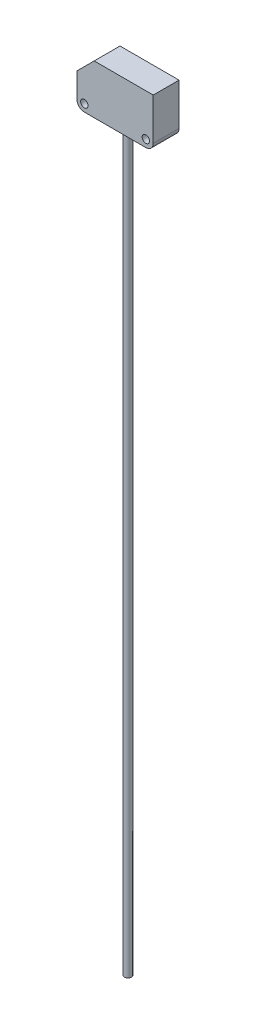
ISO-10303-21;
HEADER;
FILE_DESCRIPTION(('STEP AP214'),'2;1');
FILE_NAME('part.step','',(''),(''),'','','');
FILE_SCHEMA(('AUTOMOTIVE_DESIGN { 1 0 10303 214 1 1 1 1 }'));
ENDSEC;
DATA;
#1=APPLICATION_CONTEXT('core data for automotive mechanical design processes');
#2=APPLICATION_PROTOCOL_DEFINITION('international standard','automotive_design',2000,#1);
#3=PRODUCT_CONTEXT('',#1,'mechanical');
#4=PRODUCT('Part','Part','',(#3));
#5=PRODUCT_RELATED_PRODUCT_CATEGORY('part','',(#4));
#6=PRODUCT_DEFINITION_FORMATION('','',#4);
#7=PRODUCT_DEFINITION_CONTEXT('part definition',#1,'design');
#8=PRODUCT_DEFINITION('design','',#6,#7);
#9=PRODUCT_DEFINITION_SHAPE('','',#8);
#10=(LENGTH_UNIT() NAMED_UNIT(*) SI_UNIT(.MILLI.,.METRE.));
#11=(NAMED_UNIT(*) PLANE_ANGLE_UNIT() SI_UNIT($,.RADIAN.));
#12=(NAMED_UNIT(*) SI_UNIT($,.STERADIAN.) SOLID_ANGLE_UNIT());
#13=UNCERTAINTY_MEASURE_WITH_UNIT(LENGTH_MEASURE(1.E-05),#10,'distance_accuracy_value','');
#14=(GEOMETRIC_REPRESENTATION_CONTEXT(3) GLOBAL_UNCERTAINTY_ASSIGNED_CONTEXT((#13)) GLOBAL_UNIT_ASSIGNED_CONTEXT((#10,
#11,#12)) REPRESENTATION_CONTEXT('',''));
#15=CARTESIAN_POINT('',(0.,0.,0.));
#16=DIRECTION('',(0.,0.,1.));
#17=DIRECTION('',(1.,0.,0.));
#18=AXIS2_PLACEMENT_3D('',#15,#16,#17);
#19=CARTESIAN_POINT('',(0.,0.,-10.5));
#20=DIRECTION('',(0.,-1.,0.));
#21=DIRECTION('',(0.,0.,-1.));
#22=AXIS2_PLACEMENT_3D('',#19,#20,#21);
#23=PLANE('',#22);
#24=DIRECTION('',(1.,0.,0.));
#25=VECTOR('',#24,1.);
#26=CARTESIAN_POINT('',(0.,0.,-10.5));
#27=LINE('',#26,#25);
#28=CARTESIAN_POINT('',(3.,0.,-10.5));
#29=VERTEX_POINT('',#28);
#30=CARTESIAN_POINT('',(6.5,0.,-10.5));
#31=VERTEX_POINT('',#30);
#32=EDGE_CURVE('E163',#29,#31,#27,.T.);
#33=ORIENTED_EDGE('',*,*,#32,.T.);
#34=DIRECTION('',(0.,0.,-1.));
#35=VECTOR('',#34,1.);
#36=CARTESIAN_POINT('',(6.5,0.,0.));
#37=LINE('',#36,#35);
#38=CARTESIAN_POINT('',(6.5,0.,0.));
#39=VERTEX_POINT('',#38);
#40=EDGE_CURVE('E220',#39,#31,#37,.T.);
#41=ORIENTED_EDGE('',*,*,#40,.F.);
#42=DIRECTION('',(1.,0.,0.));
#43=VECTOR('',#42,1.);
#44=CARTESIAN_POINT('',(0.,0.,0.));
#45=LINE('',#44,#43);
#46=CARTESIAN_POINT('',(3.,0.,0.));
#47=VERTEX_POINT('',#46);
#48=EDGE_CURVE('E140',#47,#39,#45,.T.);
#49=ORIENTED_EDGE('',*,*,#48,.F.);
#50=DIRECTION('',(0.,0.,1.));
#51=VECTOR('',#50,1.);
#52=CARTESIAN_POINT('',(3.,0.,-10.5));
#53=LINE('',#52,#51);
#54=EDGE_CURVE('E188',#47,#29,#53,.F.);
#55=ORIENTED_EDGE('',*,*,#54,.T.);
#56=EDGE_LOOP('',(#33,#41,#49,#55));
#57=FACE_BOUND('',#56,.T.);
#58=ADVANCED_FACE('F34',(#57),#23,.T.);
#59=CARTESIAN_POINT('',(24.5,0.,0.));
#60=VERTEX_POINT('',#59);
#61=CARTESIAN_POINT('',(28.,0.,0.));
#62=VERTEX_POINT('',#61);
#63=EDGE_CURVE('E177',#60,#62,#45,.T.);
#64=ORIENTED_EDGE('',*,*,#63,.F.);
#65=DIRECTION('',(0.,0.,1.));
#66=VECTOR('',#65,1.);
#67=CARTESIAN_POINT('',(24.5,0.,-10.5));
#68=LINE('',#67,#66);
#69=CARTESIAN_POINT('',(24.5,0.,-10.5));
#70=VERTEX_POINT('',#69);
#71=EDGE_CURVE('E135',#70,#60,#68,.T.);
#72=ORIENTED_EDGE('',*,*,#71,.F.);
#73=CARTESIAN_POINT('',(28.,0.,-10.5));
#74=VERTEX_POINT('',#73);
#75=EDGE_CURVE('E161',#70,#74,#27,.T.);
#76=ORIENTED_EDGE('',*,*,#75,.T.);
#77=DIRECTION('',(0.,0.,1.));
#78=VECTOR('',#77,1.);
#79=CARTESIAN_POINT('',(28.,0.,-10.5));
#80=LINE('',#79,#78);
#81=EDGE_CURVE('E194',#74,#62,#80,.T.);
#82=ORIENTED_EDGE('',*,*,#81,.T.);
#83=EDGE_LOOP('',(#64,#72,#76,#82));
#84=FACE_BOUND('',#83,.T.);
#85=ADVANCED_FACE('F217',(#84),#23,.T.);
#86=CARTESIAN_POINT('',(0.,13.,-10.5));
#87=DIRECTION('',(-1.,0.,0.));
#88=DIRECTION('',(0.,-1.,0.));
#89=AXIS2_PLACEMENT_3D('',#86,#87,#88);
#90=PLANE('',#89);
#91=DIRECTION('',(0.,-1.,0.));
#92=VECTOR('',#91,1.);
#93=CARTESIAN_POINT('',(0.,13.,-10.5));
#94=LINE('',#93,#92);
#95=CARTESIAN_POINT('',(0.,13.,-10.5));
#96=VERTEX_POINT('',#95);
#97=CARTESIAN_POINT('',(0.,3.,-10.5));
#98=VERTEX_POINT('',#97);
#99=EDGE_CURVE('E159',#96,#98,#94,.T.);
#100=ORIENTED_EDGE('',*,*,#99,.T.);
#101=DIRECTION('',(0.,0.,1.));
#102=VECTOR('',#101,1.);
#103=CARTESIAN_POINT('',(0.,3.,-10.5));
#104=LINE('',#103,#102);
#105=CARTESIAN_POINT('',(0.,3.,0.));
#106=VERTEX_POINT('',#105);
#107=EDGE_CURVE('E11',#98,#106,#104,.T.);
#108=ORIENTED_EDGE('',*,*,#107,.T.);
#109=DIRECTION('',(0.,-1.,0.));
#110=VECTOR('',#109,1.);
#111=CARTESIAN_POINT('',(0.,13.,0.));
#112=LINE('',#111,#110);
#113=CARTESIAN_POINT('',(0.,13.,0.));
#114=VERTEX_POINT('',#113);
#115=EDGE_CURVE('E156',#114,#106,#112,.T.);
#116=ORIENTED_EDGE('',*,*,#115,.F.);
#117=DIRECTION('',(0.,0.,1.));
#118=VECTOR('',#117,1.);
#119=CARTESIAN_POINT('',(0.,13.,-10.5));
#120=LINE('',#119,#118);
#121=EDGE_CURVE('E186',#96,#114,#120,.T.);
#122=ORIENTED_EDGE('',*,*,#121,.F.);
#123=EDGE_LOOP('',(#100,#108,#116,#122));
#124=FACE_BOUND('',#123,.T.);
#125=ADVANCED_FACE('F255',(#124),#90,.T.);
#126=CARTESIAN_POINT('',(7.,20.,-10.5));
#127=DIRECTION('',(-0.707106781186546,0.707106781186549,0.));
#128=DIRECTION('',(-0.707106781186549,-0.707106781186546,0.));
#129=AXIS2_PLACEMENT_3D('',#126,#127,#128);
#130=PLANE('',#129);
#131=DIRECTION('',(-0.707106781186549,-0.707106781186546,0.));
#132=VECTOR('',#131,1.);
#133=CARTESIAN_POINT('',(7.,20.,0.));
#134=LINE('',#133,#132);
#135=CARTESIAN_POINT('',(7.,20.,0.));
#136=VERTEX_POINT('',#135);
#137=EDGE_CURVE('E162',#136,#114,#134,.T.);
#138=ORIENTED_EDGE('',*,*,#137,.F.);
#139=DIRECTION('',(0.,0.,1.));
#140=VECTOR('',#139,1.);
#141=CARTESIAN_POINT('',(7.,20.,-10.5));
#142=LINE('',#141,#140);
#143=CARTESIAN_POINT('',(7.,20.,-10.5));
#144=VERTEX_POINT('',#143);
#145=EDGE_CURVE('E189',#144,#136,#142,.T.);
#146=ORIENTED_EDGE('',*,*,#145,.F.);
#147=DIRECTION('',(-0.707106781186549,-0.707106781186546,0.));
#148=VECTOR('',#147,1.);
#149=CARTESIAN_POINT('',(7.,20.,-10.5));
#150=LINE('',#149,#148);
#151=EDGE_CURVE('E171',#144,#96,#150,.T.);
#152=ORIENTED_EDGE('',*,*,#151,.T.);
#153=ORIENTED_EDGE('',*,*,#121,.T.);
#154=EDGE_LOOP('',(#138,#146,#152,#153));
#155=FACE_BOUND('',#154,.T.);
#156=ADVANCED_FACE('F261',(#155),#130,.T.);
#157=CARTESIAN_POINT('',(31.,20.,-10.5));
#158=DIRECTION('',(0.,1.,0.));
#159=DIRECTION('',(0.,0.,1.));
#160=AXIS2_PLACEMENT_3D('',#157,#158,#159);
#161=PLANE('',#160);
#162=DIRECTION('',(-1.,0.,0.));
#163=VECTOR('',#162,1.);
#164=CARTESIAN_POINT('',(31.,20.,0.));
#165=LINE('',#164,#163);
#166=CARTESIAN_POINT('',(31.,20.,0.));
#167=VERTEX_POINT('',#166);
#168=EDGE_CURVE('E181',#167,#136,#165,.T.);
#169=ORIENTED_EDGE('',*,*,#168,.F.);
#170=DIRECTION('',(0.,0.,1.));
#171=VECTOR('',#170,1.);
#172=CARTESIAN_POINT('',(31.,20.,-10.5));
#173=LINE('',#172,#171);
#174=CARTESIAN_POINT('',(31.,20.,-10.5));
#175=VERTEX_POINT('',#174);
#176=EDGE_CURVE('E174',#175,#167,#173,.T.);
#177=ORIENTED_EDGE('',*,*,#176,.F.);
#178=DIRECTION('',(-1.,0.,0.));
#179=VECTOR('',#178,1.);
#180=CARTESIAN_POINT('',(31.,20.,-10.5));
#181=LINE('',#180,#179);
#182=EDGE_CURVE('E168',#175,#144,#181,.T.);
#183=ORIENTED_EDGE('',*,*,#182,.T.);
#184=ORIENTED_EDGE('',*,*,#145,.T.);
#185=EDGE_LOOP('',(#169,#177,#183,#184));
#186=FACE_BOUND('',#185,.T.);
#187=ADVANCED_FACE('F289',(#186),#161,.T.);
#188=CARTESIAN_POINT('',(31.,0.,-10.5));
#189=DIRECTION('',(1.,0.,0.));
#190=DIRECTION('',(0.,0.,-1.));
#191=AXIS2_PLACEMENT_3D('',#188,#189,#190);
#192=PLANE('',#191);
#193=DIRECTION('',(0.,1.,0.));
#194=VECTOR('',#193,1.);
#195=CARTESIAN_POINT('',(31.,0.,0.));
#196=LINE('',#195,#194);
#197=CARTESIAN_POINT('',(31.,3.,0.));
#198=VERTEX_POINT('',#197);
#199=EDGE_CURVE('E179',#198,#167,#196,.T.);
#200=ORIENTED_EDGE('',*,*,#199,.F.);
#201=DIRECTION('',(0.,0.,1.));
#202=VECTOR('',#201,1.);
#203=CARTESIAN_POINT('',(31.,3.,-10.5));
#204=LINE('',#203,#202);
#205=CARTESIAN_POINT('',(31.,3.,-10.5));
#206=VERTEX_POINT('',#205);
#207=EDGE_CURVE('E201',#198,#206,#204,.F.);
#208=ORIENTED_EDGE('',*,*,#207,.T.);
#209=DIRECTION('',(0.,1.,0.));
#210=VECTOR('',#209,1.);
#211=CARTESIAN_POINT('',(31.,0.,-10.5));
#212=LINE('',#211,#210);
#213=EDGE_CURVE('E166',#206,#175,#212,.T.);
#214=ORIENTED_EDGE('',*,*,#213,.T.);
#215=ORIENTED_EDGE('',*,*,#176,.T.);
#216=EDGE_LOOP('',(#200,#208,#214,#215));
#217=FACE_BOUND('',#216,.T.);
#218=ADVANCED_FACE('F258',(#217),#192,.T.);
#219=CARTESIAN_POINT('',(0.,0.,-10.5));
#220=DIRECTION('',(0.,0.,1.));
#221=DIRECTION('',(1.,0.,0.));
#222=AXIS2_PLACEMENT_3D('',#219,#220,#221);
#223=PLANE('',#222);
#224=CARTESIAN_POINT('',(28.,3.,-10.5));
#225=DIRECTION('',(0.,0.,1.));
#226=DIRECTION('',(1.,0.,0.));
#227=AXIS2_PLACEMENT_3D('',#224,#225,#226);
#228=CIRCLE('',#227,1.5);
#229=CARTESIAN_POINT('',(29.5,3.,-10.5));
#230=VERTEX_POINT('',#229);
#231=EDGE_CURVE('E144',#230,#230,#228,.T.);
#232=ORIENTED_EDGE('',*,*,#231,.T.);
#233=EDGE_LOOP('',(#232));
#234=FACE_BOUND('',#233,.T.);
#235=CARTESIAN_POINT('',(3.,3.,-10.5));
#236=DIRECTION('',(0.,0.,1.));
#237=DIRECTION('',(1.,0.,0.));
#238=AXIS2_PLACEMENT_3D('',#235,#236,#237);
#239=CIRCLE('',#238,1.5);
#240=CARTESIAN_POINT('',(4.5,3.,-10.5));
#241=VERTEX_POINT('',#240);
#242=EDGE_CURVE('E153',#241,#241,#239,.T.);
#243=ORIENTED_EDGE('',*,*,#242,.T.);
#244=EDGE_LOOP('',(#243));
#245=FACE_BOUND('',#244,.T.);
#246=ORIENTED_EDGE('',*,*,#213,.F.);
#247=CARTESIAN_POINT('',(28.,3.,-10.5));
#248=DIRECTION('',(0.,0.,1.));
#249=DIRECTION('',(1.,0.,0.));
#250=AXIS2_PLACEMENT_3D('',#247,#248,#249);
#251=CIRCLE('',#250,3.);
#252=EDGE_CURVE('E42',#206,#74,#251,.F.);
#253=ORIENTED_EDGE('',*,*,#252,.T.);
#254=ORIENTED_EDGE('',*,*,#75,.F.);
#255=DIRECTION('',(0.,1.,0.));
#256=VECTOR('',#255,1.);
#257=CARTESIAN_POINT('',(24.5,-0.01,-10.5));
#258=LINE('',#257,#256);
#259=CARTESIAN_POINT('',(24.5,-0.01,-10.5));
#260=VERTEX_POINT('',#259);
#261=EDGE_CURVE('E146',#260,#70,#258,.T.);
#262=ORIENTED_EDGE('',*,*,#261,.F.);
#263=DIRECTION('',(1.,0.,0.));
#264=VECTOR('',#263,1.);
#265=CARTESIAN_POINT('',(6.5,-0.01,-10.5));
#266=LINE('',#265,#264);
#267=CARTESIAN_POINT('',(6.5,-0.01,-10.5));
#268=VERTEX_POINT('',#267);
#269=EDGE_CURVE('E129',#268,#260,#266,.T.);
#270=ORIENTED_EDGE('',*,*,#269,.F.);
#271=DIRECTION('',(0.,1.,0.));
#272=VECTOR('',#271,1.);
#273=CARTESIAN_POINT('',(6.5,-0.01,-10.5));
#274=LINE('',#273,#272);
#275=EDGE_CURVE('E126',#268,#31,#274,.T.);
#276=ORIENTED_EDGE('',*,*,#275,.T.);
#277=ORIENTED_EDGE('',*,*,#32,.F.);
#278=CARTESIAN_POINT('',(3.,3.,-10.5));
#279=DIRECTION('',(0.,0.,1.));
#280=DIRECTION('',(1.,0.,0.));
#281=AXIS2_PLACEMENT_3D('',#278,#279,#280);
#282=CIRCLE('',#281,3.);
#283=EDGE_CURVE('E57',#29,#98,#282,.F.);
#284=ORIENTED_EDGE('',*,*,#283,.T.);
#285=ORIENTED_EDGE('',*,*,#99,.F.);
#286=ORIENTED_EDGE('',*,*,#151,.F.);
#287=ORIENTED_EDGE('',*,*,#182,.F.);
#288=EDGE_LOOP('',(#246,#253,#254,#262,#270,#276,#277,#284,#285,#286,#287));
#289=FACE_BOUND('',#288,.T.);
#290=ADVANCED_FACE('F208',(#234,#245,#289),#223,.F.);
#291=CARTESIAN_POINT('',(0.,0.,0.));
#292=DIRECTION('',(0.,0.,1.));
#293=DIRECTION('',(1.,0.,0.));
#294=AXIS2_PLACEMENT_3D('',#291,#292,#293);
#295=PLANE('',#294);
#296=CARTESIAN_POINT('',(28.,3.,0.));
#297=DIRECTION('',(0.,0.,1.));
#298=DIRECTION('',(1.,0.,0.));
#299=AXIS2_PLACEMENT_3D('',#296,#297,#298);
#300=CIRCLE('',#299,1.5);
#301=CARTESIAN_POINT('',(29.5,3.,0.));
#302=VERTEX_POINT('',#301);
#303=EDGE_CURVE('E141',#302,#302,#300,.T.);
#304=ORIENTED_EDGE('',*,*,#303,.F.);
#305=EDGE_LOOP('',(#304));
#306=FACE_BOUND('',#305,.T.);
#307=CARTESIAN_POINT('',(3.,3.,0.));
#308=DIRECTION('',(0.,0.,1.));
#309=DIRECTION('',(1.,0.,0.));
#310=AXIS2_PLACEMENT_3D('',#307,#308,#309);
#311=CIRCLE('',#310,1.5);
#312=CARTESIAN_POINT('',(4.5,3.,0.));
#313=VERTEX_POINT('',#312);
#314=EDGE_CURVE('E151',#313,#313,#311,.T.);
#315=ORIENTED_EDGE('',*,*,#314,.F.);
#316=EDGE_LOOP('',(#315));
#317=FACE_BOUND('',#316,.T.);
#318=ORIENTED_EDGE('',*,*,#48,.T.);
#319=DIRECTION('',(0.,1.,0.));
#320=VECTOR('',#319,1.);
#321=CARTESIAN_POINT('',(6.5,-0.01,0.));
#322=LINE('',#321,#320);
#323=CARTESIAN_POINT('',(6.5,-0.01,0.));
#324=VERTEX_POINT('',#323);
#325=EDGE_CURVE('E123',#324,#39,#322,.T.);
#326=ORIENTED_EDGE('',*,*,#325,.F.);
#327=DIRECTION('',(-1.,0.,0.));
#328=VECTOR('',#327,1.);
#329=CARTESIAN_POINT('',(24.5,-0.01,0.));
#330=LINE('',#329,#328);
#331=CARTESIAN_POINT('',(24.5,-0.01,0.));
#332=VERTEX_POINT('',#331);
#333=EDGE_CURVE('E130',#332,#324,#330,.T.);
#334=ORIENTED_EDGE('',*,*,#333,.F.);
#335=DIRECTION('',(0.,1.,0.));
#336=VECTOR('',#335,1.);
#337=CARTESIAN_POINT('',(24.5,-0.01,0.));
#338=LINE('',#337,#336);
#339=EDGE_CURVE('E49',#332,#60,#338,.T.);
#340=ORIENTED_EDGE('',*,*,#339,.T.);
#341=ORIENTED_EDGE('',*,*,#63,.T.);
#342=CARTESIAN_POINT('',(28.,3.,0.));
#343=DIRECTION('',(0.,0.,1.));
#344=DIRECTION('',(1.,0.,0.));
#345=AXIS2_PLACEMENT_3D('',#342,#343,#344);
#346=CIRCLE('',#345,3.);
#347=EDGE_CURVE('E199',#62,#198,#346,.T.);
#348=ORIENTED_EDGE('',*,*,#347,.T.);
#349=ORIENTED_EDGE('',*,*,#199,.T.);
#350=ORIENTED_EDGE('',*,*,#168,.T.);
#351=ORIENTED_EDGE('',*,*,#137,.T.);
#352=ORIENTED_EDGE('',*,*,#115,.T.);
#353=CARTESIAN_POINT('',(3.,3.,0.));
#354=DIRECTION('',(0.,0.,1.));
#355=DIRECTION('',(1.,0.,0.));
#356=AXIS2_PLACEMENT_3D('',#353,#354,#355);
#357=CIRCLE('',#356,3.);
#358=EDGE_CURVE('E197',#106,#47,#357,.T.);
#359=ORIENTED_EDGE('',*,*,#358,.T.);
#360=EDGE_LOOP('',(#318,#326,#334,#340,#341,#348,#349,#350,#351,#352,#359));
#361=FACE_BOUND('',#360,.T.);
#362=ADVANCED_FACE('F138',(#306,#317,#361),#295,.T.);
#363=CARTESIAN_POINT('',(3.,3.,-10.5));
#364=DIRECTION('',(0.,0.,1.));
#365=DIRECTION('',(1.,0.,0.));
#366=AXIS2_PLACEMENT_3D('',#363,#364,#365);
#367=CYLINDRICAL_SURFACE('',#366,1.5);
#368=ORIENTED_EDGE('',*,*,#242,.F.);
#369=EDGE_LOOP('',(#368));
#370=FACE_BOUND('',#369,.T.);
#371=ORIENTED_EDGE('',*,*,#314,.T.);
#372=EDGE_LOOP('',(#371));
#373=FACE_BOUND('',#372,.T.);
#374=ADVANCED_FACE('F270',(#370,#373),#367,.F.);
#375=CARTESIAN_POINT('',(28.,3.,-10.5));
#376=DIRECTION('',(0.,0.,1.));
#377=DIRECTION('',(1.,0.,0.));
#378=AXIS2_PLACEMENT_3D('',#375,#376,#377);
#379=CYLINDRICAL_SURFACE('',#378,1.5);
#380=ORIENTED_EDGE('',*,*,#231,.F.);
#381=EDGE_LOOP('',(#380));
#382=FACE_BOUND('',#381,.T.);
#383=ORIENTED_EDGE('',*,*,#303,.T.);
#384=EDGE_LOOP('',(#383));
#385=FACE_BOUND('',#384,.T.);
#386=ADVANCED_FACE('F264',(#382,#385),#379,.F.);
#387=CARTESIAN_POINT('',(28.,3.,-10.5));
#388=DIRECTION('',(0.,0.,1.));
#389=DIRECTION('',(1.,0.,0.));
#390=AXIS2_PLACEMENT_3D('',#387,#388,#389);
#391=CYLINDRICAL_SURFACE('',#390,3.);
#392=ORIENTED_EDGE('',*,*,#252,.F.);
#393=ORIENTED_EDGE('',*,*,#207,.F.);
#394=ORIENTED_EDGE('',*,*,#347,.F.);
#395=ORIENTED_EDGE('',*,*,#81,.F.);
#396=EDGE_LOOP('',(#392,#393,#394,#395));
#397=FACE_BOUND('',#396,.T.);
#398=ADVANCED_FACE('F214',(#397),#391,.T.);
#399=CARTESIAN_POINT('',(3.,3.,-10.5));
#400=DIRECTION('',(0.,0.,1.));
#401=DIRECTION('',(1.,0.,0.));
#402=AXIS2_PLACEMENT_3D('',#399,#400,#401);
#403=CYLINDRICAL_SURFACE('',#402,3.);
#404=ORIENTED_EDGE('',*,*,#283,.F.);
#405=ORIENTED_EDGE('',*,*,#54,.F.);
#406=ORIENTED_EDGE('',*,*,#358,.F.);
#407=ORIENTED_EDGE('',*,*,#107,.F.);
#408=EDGE_LOOP('',(#404,#405,#406,#407));
#409=FACE_BOUND('',#408,.T.);
#410=ADVANCED_FACE('F36',(#409),#403,.T.);
#411=CARTESIAN_POINT('',(6.5,-0.01,0.));
#412=DIRECTION('',(1.,0.,0.));
#413=DIRECTION('',(0.,0.,-1.));
#414=AXIS2_PLACEMENT_3D('',#411,#412,#413);
#415=PLANE('',#414);
#416=ORIENTED_EDGE('',*,*,#40,.T.);
#417=ORIENTED_EDGE('',*,*,#275,.F.);
#418=DIRECTION('',(0.,0.,-1.));
#419=VECTOR('',#418,1.);
#420=CARTESIAN_POINT('',(6.5,-0.01,0.));
#421=LINE('',#420,#419);
#422=EDGE_CURVE('E119',#324,#268,#421,.T.);
#423=ORIENTED_EDGE('',*,*,#422,.F.);
#424=ORIENTED_EDGE('',*,*,#325,.T.);
#425=EDGE_LOOP('',(#416,#417,#423,#424));
#426=FACE_BOUND('',#425,.T.);
#427=ADVANCED_FACE('F121',(#426),#415,.F.);
#428=CARTESIAN_POINT('',(24.5,-0.01,-10.5));
#429=DIRECTION('',(-1.,0.,0.));
#430=DIRECTION('',(0.,0.,1.));
#431=AXIS2_PLACEMENT_3D('',#428,#429,#430);
#432=PLANE('',#431);
#433=ORIENTED_EDGE('',*,*,#71,.T.);
#434=ORIENTED_EDGE('',*,*,#339,.F.);
#435=DIRECTION('',(0.,0.,1.));
#436=VECTOR('',#435,1.);
#437=CARTESIAN_POINT('',(24.5,-0.01,-10.5));
#438=LINE('',#437,#436);
#439=EDGE_CURVE('E134',#260,#332,#438,.T.);
#440=ORIENTED_EDGE('',*,*,#439,.F.);
#441=ORIENTED_EDGE('',*,*,#261,.T.);
#442=EDGE_LOOP('',(#433,#434,#440,#441));
#443=FACE_BOUND('',#442,.T.);
#444=ADVANCED_FACE('F226',(#443),#432,.F.);
#445=CARTESIAN_POINT('',(6.5,-0.01,0.));
#446=DIRECTION('',(0.,-1.,0.));
#447=DIRECTION('',(0.,0.,-1.));
#448=AXIS2_PLACEMENT_3D('',#445,#446,#447);
#449=PLANE('',#448);
#450=CARTESIAN_POINT('',(15.5,-0.01,-5.25));
#451=DIRECTION('',(0.,-1.,0.));
#452=DIRECTION('',(0.,0.,-1.));
#453=AXIS2_PLACEMENT_3D('',#450,#451,#452);
#454=CIRCLE('',#453,1.5);
#455=CARTESIAN_POINT('',(15.5,-0.01,-6.75));
#456=VERTEX_POINT('',#455);
#457=EDGE_CURVE('E229',#456,#456,#454,.T.);
#458=ORIENTED_EDGE('',*,*,#457,.F.);
#459=EDGE_LOOP('',(#458));
#460=FACE_BOUND('',#459,.T.);
#461=ORIENTED_EDGE('',*,*,#333,.T.);
#462=ORIENTED_EDGE('',*,*,#422,.T.);
#463=ORIENTED_EDGE('',*,*,#269,.T.);
#464=ORIENTED_EDGE('',*,*,#439,.T.);
#465=EDGE_LOOP('',(#461,#462,#463,#464));
#466=FACE_BOUND('',#465,.T.);
#467=ADVANCED_FACE('F132',(#460,#466),#449,.T.);
#468=CARTESIAN_POINT('',(15.5,-300.01,-5.25));
#469=DIRECTION('',(0.,1.,0.));
#470=DIRECTION('',(0.,0.,1.));
#471=AXIS2_PLACEMENT_3D('',#468,#469,#470);
#472=CYLINDRICAL_SURFACE('',#471,1.5);
#473=CARTESIAN_POINT('',(15.5,-300.01,-5.25));
#474=DIRECTION('',(0.,-1.,0.));
#475=DIRECTION('',(0.,0.,-1.));
#476=AXIS2_PLACEMENT_3D('',#473,#474,#475);
#477=CIRCLE('',#476,1.5);
#478=CARTESIAN_POINT('',(15.5,-300.01,-6.75));
#479=VERTEX_POINT('',#478);
#480=EDGE_CURVE('E222',#479,#479,#477,.T.);
#481=ORIENTED_EDGE('',*,*,#480,.F.);
#482=EDGE_LOOP('',(#481));
#483=FACE_BOUND('',#482,.T.);
#484=ORIENTED_EDGE('',*,*,#457,.T.);
#485=EDGE_LOOP('',(#484));
#486=FACE_BOUND('',#485,.T.);
#487=ADVANCED_FACE('F237',(#483,#486),#472,.T.);
#488=CARTESIAN_POINT('',(15.5,-300.01,-5.25));
#489=DIRECTION('',(0.,-1.,0.));
#490=DIRECTION('',(0.,0.,-1.));
#491=AXIS2_PLACEMENT_3D('',#488,#489,#490);
#492=PLANE('',#491);
#493=ORIENTED_EDGE('',*,*,#480,.T.);
#494=EDGE_LOOP('',(#493));
#495=FACE_BOUND('',#494,.T.);
#496=ADVANCED_FACE('F235',(#495),#492,.T.);
#497=CLOSED_SHELL('',(#58,#85,#125,#156,#187,#218,#290,#362,#374,#386,#398,#410,#427,#444,#467,
#487,#496));
#498=MANIFOLD_SOLID_BREP('B2',#497);
#499=ADVANCED_BREP_SHAPE_REPRESENTATION('',(#18,#498),#14);
#500=SHAPE_DEFINITION_REPRESENTATION(#9,#499);
ENDSEC;
END-ISO-10303-21;
